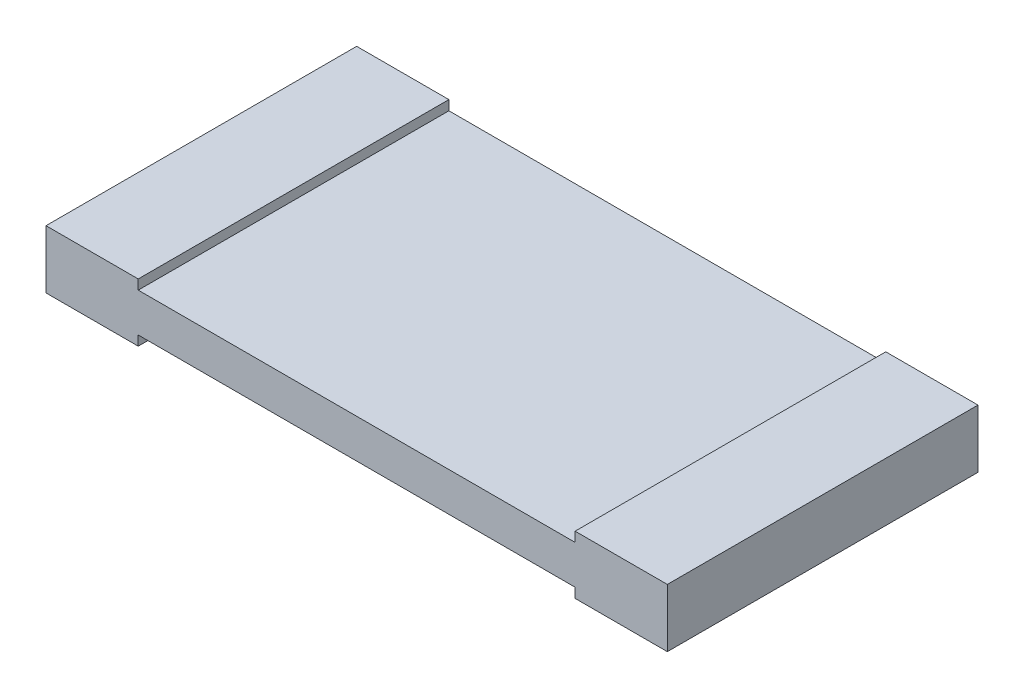
ISO-10303-21;
HEADER;
FILE_DESCRIPTION(('STEP AP214'),'2;1');
FILE_NAME('part.step','',(''),(''),'','','');
FILE_SCHEMA(('AUTOMOTIVE_DESIGN { 1 0 10303 214 1 1 1 1 }'));
ENDSEC;
DATA;
#1=APPLICATION_CONTEXT('core data for automotive mechanical design processes');
#2=APPLICATION_PROTOCOL_DEFINITION('international standard','automotive_design',2000,#1);
#3=PRODUCT_CONTEXT('',#1,'mechanical');
#4=PRODUCT('Part','Part','',(#3));
#5=PRODUCT_RELATED_PRODUCT_CATEGORY('part','',(#4));
#6=PRODUCT_DEFINITION_FORMATION('','',#4);
#7=PRODUCT_DEFINITION_CONTEXT('part definition',#1,'design');
#8=PRODUCT_DEFINITION('design','',#6,#7);
#9=PRODUCT_DEFINITION_SHAPE('','',#8);
#10=(LENGTH_UNIT() NAMED_UNIT(*) SI_UNIT(.MILLI.,.METRE.));
#11=(NAMED_UNIT(*) PLANE_ANGLE_UNIT() SI_UNIT($,.RADIAN.));
#12=(NAMED_UNIT(*) SI_UNIT($,.STERADIAN.) SOLID_ANGLE_UNIT());
#13=UNCERTAINTY_MEASURE_WITH_UNIT(LENGTH_MEASURE(1.E-05),#10,'distance_accuracy_value','');
#14=(GEOMETRIC_REPRESENTATION_CONTEXT(3) GLOBAL_UNCERTAINTY_ASSIGNED_CONTEXT((#13)) GLOBAL_UNIT_ASSIGNED_CONTEXT((#10,
#11,#12)) REPRESENTATION_CONTEXT('',''));
#15=CARTESIAN_POINT('',(0.,0.,0.));
#16=DIRECTION('',(0.,0.,1.));
#17=DIRECTION('',(1.,0.,0.));
#18=AXIS2_PLACEMENT_3D('',#15,#16,#17);
#19=CARTESIAN_POINT('',(-3.2,0.6,1.6));
#20=DIRECTION('',(0.,-1.,0.));
#21=DIRECTION('',(0.,0.,-1.));
#22=AXIS2_PLACEMENT_3D('',#19,#20,#21);
#23=PLANE('',#22);
#24=DIRECTION('',(0.,0.,-1.));
#25=VECTOR('',#24,1.);
#26=CARTESIAN_POINT('',(-2.25,0.6,0.));
#27=LINE('',#26,#25);
#28=CARTESIAN_POINT('',(-2.25,0.6,1.6));
#29=VERTEX_POINT('',#28);
#30=CARTESIAN_POINT('',(-2.25,0.6,-1.6));
#31=VERTEX_POINT('',#30);
#32=EDGE_CURVE('E123',#29,#31,#27,.T.);
#33=ORIENTED_EDGE('',*,*,#32,.T.);
#34=DIRECTION('',(1.,0.,0.));
#35=VECTOR('',#34,1.);
#36=CARTESIAN_POINT('',(-2.725,0.6,-1.6));
#37=LINE('',#36,#35);
#38=CARTESIAN_POINT('',(-3.2,0.6,-1.6));
#39=VERTEX_POINT('',#38);
#40=EDGE_CURVE('E20',#39,#31,#37,.T.);
#41=ORIENTED_EDGE('',*,*,#40,.F.);
#42=DIRECTION('',(0.,0.,1.));
#43=VECTOR('',#42,1.);
#44=CARTESIAN_POINT('',(-3.2,0.6,0.));
#45=LINE('',#44,#43);
#46=CARTESIAN_POINT('',(-3.2,0.6,1.6));
#47=VERTEX_POINT('',#46);
#48=EDGE_CURVE('E118',#39,#47,#45,.T.);
#49=ORIENTED_EDGE('',*,*,#48,.T.);
#50=DIRECTION('',(-1.,0.,0.));
#51=VECTOR('',#50,1.);
#52=CARTESIAN_POINT('',(-2.725,0.6,1.6));
#53=LINE('',#52,#51);
#54=EDGE_CURVE('E103',#29,#47,#53,.T.);
#55=ORIENTED_EDGE('',*,*,#54,.F.);
#56=EDGE_LOOP('',(#33,#41,#49,#55));
#57=FACE_BOUND('',#56,.T.);
#58=ADVANCED_FACE('F16',(#57),#23,.F.);
#59=CARTESIAN_POINT('',(-3.2,0.,1.6));
#60=DIRECTION('',(1.,0.,0.));
#61=DIRECTION('',(0.,0.,-1.));
#62=AXIS2_PLACEMENT_3D('',#59,#60,#61);
#63=PLANE('',#62);
#64=DIRECTION('',(0.,-1.,0.));
#65=VECTOR('',#64,1.);
#66=CARTESIAN_POINT('',(-3.2,0.3,1.6));
#67=LINE('',#66,#65);
#68=CARTESIAN_POINT('',(-3.2,0.,1.6));
#69=VERTEX_POINT('',#68);
#70=EDGE_CURVE('E126',#47,#69,#67,.T.);
#71=ORIENTED_EDGE('',*,*,#70,.F.);
#72=ORIENTED_EDGE('',*,*,#48,.F.);
#73=DIRECTION('',(0.,1.,0.));
#74=VECTOR('',#73,1.);
#75=CARTESIAN_POINT('',(-3.2,0.3,-1.6));
#76=LINE('',#75,#74);
#77=CARTESIAN_POINT('',(-3.2,0.,-1.6));
#78=VERTEX_POINT('',#77);
#79=EDGE_CURVE('E108',#78,#39,#76,.T.);
#80=ORIENTED_EDGE('',*,*,#79,.F.);
#81=DIRECTION('',(0.,0.,-1.));
#82=VECTOR('',#81,1.);
#83=CARTESIAN_POINT('',(-3.2,0.,0.));
#84=LINE('',#83,#82);
#85=EDGE_CURVE('E138',#69,#78,#84,.T.);
#86=ORIENTED_EDGE('',*,*,#85,.F.);
#87=EDGE_LOOP('',(#71,#72,#80,#86));
#88=FACE_BOUND('',#87,.T.);
#89=ADVANCED_FACE('F125',(#88),#63,.F.);
#90=CARTESIAN_POINT('',(-2.25,0.5,-1.6));
#91=DIRECTION('',(-1.,0.,0.));
#92=DIRECTION('',(0.,0.,1.));
#93=AXIS2_PLACEMENT_3D('',#90,#91,#92);
#94=PLANE('',#93);
#95=DIRECTION('',(0.,0.,-1.));
#96=VECTOR('',#95,1.);
#97=CARTESIAN_POINT('',(-2.25,0.5,0.));
#98=LINE('',#97,#96);
#99=CARTESIAN_POINT('',(-2.25,0.49999999995,1.6));
#100=VERTEX_POINT('',#99);
#101=CARTESIAN_POINT('',(-2.25,0.49999999995,-1.6));
#102=VERTEX_POINT('',#101);
#103=EDGE_CURVE('E140',#100,#102,#98,.T.);
#104=ORIENTED_EDGE('',*,*,#103,.T.);
#105=DIRECTION('',(0.,-1.,0.));
#106=VECTOR('',#105,1.);
#107=CARTESIAN_POINT('',(-2.25,0.55,-1.6));
#108=LINE('',#107,#106);
#109=EDGE_CURVE('E131',#31,#102,#108,.T.);
#110=ORIENTED_EDGE('',*,*,#109,.F.);
#111=ORIENTED_EDGE('',*,*,#32,.F.);
#112=DIRECTION('',(0.,1.,0.));
#113=VECTOR('',#112,1.);
#114=CARTESIAN_POINT('',(-2.25,0.55,1.6));
#115=LINE('',#114,#113);
#116=EDGE_CURVE('E133',#100,#29,#115,.T.);
#117=ORIENTED_EDGE('',*,*,#116,.F.);
#118=EDGE_LOOP('',(#104,#110,#111,#117));
#119=FACE_BOUND('',#118,.T.);
#120=ADVANCED_FACE('F222',(#119),#94,.F.);
#121=CARTESIAN_POINT('',(-3.2,0.,1.6));
#122=DIRECTION('',(0.,-1.,0.));
#123=DIRECTION('',(0.,0.,-1.));
#124=AXIS2_PLACEMENT_3D('',#121,#122,#123);
#125=PLANE('',#124);
#126=ORIENTED_EDGE('',*,*,#85,.T.);
#127=DIRECTION('',(1.,0.,0.));
#128=VECTOR('',#127,1.);
#129=CARTESIAN_POINT('',(0.,0.,-1.6));
#130=LINE('',#129,#128);
#131=CARTESIAN_POINT('',(-2.25,0.,-1.6));
#132=VERTEX_POINT('',#131);
#133=EDGE_CURVE('E113',#78,#132,#130,.T.);
#134=ORIENTED_EDGE('',*,*,#133,.T.);
#135=DIRECTION('',(0.,0.,1.));
#136=VECTOR('',#135,1.);
#137=CARTESIAN_POINT('',(-2.25,0.,0.));
#138=LINE('',#137,#136);
#139=CARTESIAN_POINT('',(-2.25,0.,1.6));
#140=VERTEX_POINT('',#139);
#141=EDGE_CURVE('E157',#132,#140,#138,.T.);
#142=ORIENTED_EDGE('',*,*,#141,.T.);
#143=DIRECTION('',(-1.,0.,0.));
#144=VECTOR('',#143,1.);
#145=CARTESIAN_POINT('',(-2.725,0.,1.6));
#146=LINE('',#145,#144);
#147=EDGE_CURVE('E135',#140,#69,#146,.T.);
#148=ORIENTED_EDGE('',*,*,#147,.T.);
#149=EDGE_LOOP('',(#126,#134,#142,#148));
#150=FACE_BOUND('',#149,.T.);
#151=ADVANCED_FACE('F224',(#150),#125,.T.);
#152=CARTESIAN_POINT('',(-2.25,0.5,1.6));
#153=DIRECTION('',(0.,-1.,0.));
#154=DIRECTION('',(0.,0.,-1.));
#155=AXIS2_PLACEMENT_3D('',#152,#153,#154);
#156=PLANE('',#155);
#157=DIRECTION('',(0.,0.,-1.));
#158=VECTOR('',#157,1.);
#159=CARTESIAN_POINT('',(2.25,0.5,0.));
#160=LINE('',#159,#158);
#161=CARTESIAN_POINT('',(2.25,0.49999999995,1.6));
#162=VERTEX_POINT('',#161);
#163=CARTESIAN_POINT('',(2.25,0.49999999995,-1.6));
#164=VERTEX_POINT('',#163);
#165=EDGE_CURVE('E172',#162,#164,#160,.T.);
#166=ORIENTED_EDGE('',*,*,#165,.T.);
#167=DIRECTION('',(-1.,0.,0.));
#168=VECTOR('',#167,1.);
#169=CARTESIAN_POINT('',(0.,0.4999999998,-1.6));
#170=LINE('',#169,#168);
#171=EDGE_CURVE('E147',#164,#102,#170,.T.);
#172=ORIENTED_EDGE('',*,*,#171,.T.);
#173=ORIENTED_EDGE('',*,*,#103,.F.);
#174=DIRECTION('',(1.,0.,0.));
#175=VECTOR('',#174,1.);
#176=CARTESIAN_POINT('',(0.,0.4999999998,1.6));
#177=LINE('',#176,#175);
#178=EDGE_CURVE('E163',#100,#162,#177,.T.);
#179=ORIENTED_EDGE('',*,*,#178,.T.);
#180=EDGE_LOOP('',(#166,#172,#173,#179));
#181=FACE_BOUND('',#180,.T.);
#182=ADVANCED_FACE('F219',(#181),#156,.F.);
#183=CARTESIAN_POINT('',(-3.2,0.,-1.6));
#184=DIRECTION('',(0.,0.,1.));
#185=DIRECTION('',(1.,0.,0.));
#186=AXIS2_PLACEMENT_3D('',#183,#184,#185);
#187=PLANE('',#186);
#188=DIRECTION('',(0.,-1.,0.));
#189=VECTOR('',#188,1.);
#190=CARTESIAN_POINT('',(2.25,0.3,-1.6));
#191=LINE('',#190,#189);
#192=CARTESIAN_POINT('',(2.25,0.1000000001,-1.6));
#193=VERTEX_POINT('',#192);
#194=CARTESIAN_POINT('',(2.25,0.,-1.6));
#195=VERTEX_POINT('',#194);
#196=EDGE_CURVE('E151',#193,#195,#191,.T.);
#197=ORIENTED_EDGE('',*,*,#196,.F.);
#198=DIRECTION('',(-1.,0.,0.));
#199=VECTOR('',#198,1.);
#200=CARTESIAN_POINT('',(0.,0.1,-1.6));
#201=LINE('',#200,#199);
#202=CARTESIAN_POINT('',(-2.25,0.1000000001,-1.6));
#203=VERTEX_POINT('',#202);
#204=EDGE_CURVE('E180',#193,#203,#201,.T.);
#205=ORIENTED_EDGE('',*,*,#204,.T.);
#206=DIRECTION('',(0.,-1.,0.));
#207=VECTOR('',#206,1.);
#208=CARTESIAN_POINT('',(-2.25,0.05,-1.6));
#209=LINE('',#208,#207);
#210=EDGE_CURVE('E155',#203,#132,#209,.T.);
#211=ORIENTED_EDGE('',*,*,#210,.T.);
#212=ORIENTED_EDGE('',*,*,#133,.F.);
#213=ORIENTED_EDGE('',*,*,#79,.T.);
#214=ORIENTED_EDGE('',*,*,#40,.T.);
#215=ORIENTED_EDGE('',*,*,#109,.T.);
#216=ORIENTED_EDGE('',*,*,#171,.F.);
#217=DIRECTION('',(0.,1.,0.));
#218=VECTOR('',#217,1.);
#219=CARTESIAN_POINT('',(2.25,0.55,-1.6));
#220=LINE('',#219,#218);
#221=CARTESIAN_POINT('',(2.25,0.6,-1.6));
#222=VERTEX_POINT('',#221);
#223=EDGE_CURVE('E174',#164,#222,#220,.T.);
#224=ORIENTED_EDGE('',*,*,#223,.T.);
#225=DIRECTION('',(-1.,0.,0.));
#226=VECTOR('',#225,1.);
#227=CARTESIAN_POINT('',(0.,0.6,-1.6));
#228=LINE('',#227,#226);
#229=CARTESIAN_POINT('',(3.2,0.6,-1.6));
#230=VERTEX_POINT('',#229);
#231=EDGE_CURVE('E145',#230,#222,#228,.T.);
#232=ORIENTED_EDGE('',*,*,#231,.F.);
#233=DIRECTION('',(0.,1.,0.));
#234=VECTOR('',#233,1.);
#235=CARTESIAN_POINT('',(3.2,0.3,-1.6));
#236=LINE('',#235,#234);
#237=CARTESIAN_POINT('',(3.2,0.,-1.6));
#238=VERTEX_POINT('',#237);
#239=EDGE_CURVE('E143',#238,#230,#236,.T.);
#240=ORIENTED_EDGE('',*,*,#239,.F.);
#241=DIRECTION('',(1.,0.,0.));
#242=VECTOR('',#241,1.);
#243=CARTESIAN_POINT('',(0.,0.,-1.6));
#244=LINE('',#243,#242);
#245=EDGE_CURVE('E153',#195,#238,#244,.T.);
#246=ORIENTED_EDGE('',*,*,#245,.F.);
#247=EDGE_LOOP('',(#197,#205,#211,#212,#213,#214,#215,#216,#224,#232,#240,#246));
#248=FACE_BOUND('',#247,.T.);
#249=ADVANCED_FACE('F110',(#248),#187,.F.);
#250=CARTESIAN_POINT('',(-2.25,0.,-1.6));
#251=DIRECTION('',(-1.,0.,0.));
#252=DIRECTION('',(0.,0.,1.));
#253=AXIS2_PLACEMENT_3D('',#250,#251,#252);
#254=PLANE('',#253);
#255=ORIENTED_EDGE('',*,*,#141,.F.);
#256=ORIENTED_EDGE('',*,*,#210,.F.);
#257=DIRECTION('',(0.,0.,1.));
#258=VECTOR('',#257,1.);
#259=CARTESIAN_POINT('',(-2.25,0.1,0.));
#260=LINE('',#259,#258);
#261=CARTESIAN_POINT('',(-2.25,0.10000000005,1.6));
#262=VERTEX_POINT('',#261);
#263=EDGE_CURVE('E182',#203,#262,#260,.T.);
#264=ORIENTED_EDGE('',*,*,#263,.T.);
#265=DIRECTION('',(0.,-1.,0.));
#266=VECTOR('',#265,1.);
#267=CARTESIAN_POINT('',(-2.25,0.3,1.6));
#268=LINE('',#267,#266);
#269=EDGE_CURVE('E160',#262,#140,#268,.T.);
#270=ORIENTED_EDGE('',*,*,#269,.T.);
#271=EDGE_LOOP('',(#255,#256,#264,#270));
#272=FACE_BOUND('',#271,.T.);
#273=ADVANCED_FACE('F254',(#272),#254,.F.);
#274=CARTESIAN_POINT('',(3.2,0.,1.6));
#275=DIRECTION('',(0.,0.,-1.));
#276=DIRECTION('',(-1.,0.,0.));
#277=AXIS2_PLACEMENT_3D('',#274,#275,#276);
#278=PLANE('',#277);
#279=DIRECTION('',(0.,1.,0.));
#280=VECTOR('',#279,1.);
#281=CARTESIAN_POINT('',(2.25,0.3,1.6));
#282=LINE('',#281,#280);
#283=CARTESIAN_POINT('',(2.25,0.,1.6));
#284=VERTEX_POINT('',#283);
#285=CARTESIAN_POINT('',(2.25,0.1000000001,1.6));
#286=VERTEX_POINT('',#285);
#287=EDGE_CURVE('E35',#284,#286,#282,.T.);
#288=ORIENTED_EDGE('',*,*,#287,.F.);
#289=DIRECTION('',(-1.,0.,0.));
#290=VECTOR('',#289,1.);
#291=CARTESIAN_POINT('',(0.,0.,1.6));
#292=LINE('',#291,#290);
#293=CARTESIAN_POINT('',(3.2,0.,1.6));
#294=VERTEX_POINT('',#293);
#295=EDGE_CURVE('E169',#294,#284,#292,.T.);
#296=ORIENTED_EDGE('',*,*,#295,.F.);
#297=DIRECTION('',(0.,-1.,0.));
#298=VECTOR('',#297,1.);
#299=CARTESIAN_POINT('',(3.2,0.3,1.6));
#300=LINE('',#299,#298);
#301=CARTESIAN_POINT('',(3.2,0.6,1.6));
#302=VERTEX_POINT('',#301);
#303=EDGE_CURVE('E167',#302,#294,#300,.T.);
#304=ORIENTED_EDGE('',*,*,#303,.F.);
#305=DIRECTION('',(1.,0.,0.));
#306=VECTOR('',#305,1.);
#307=CARTESIAN_POINT('',(0.,0.6,1.6));
#308=LINE('',#307,#306);
#309=CARTESIAN_POINT('',(2.25,0.6,1.6));
#310=VERTEX_POINT('',#309);
#311=EDGE_CURVE('E165',#310,#302,#308,.T.);
#312=ORIENTED_EDGE('',*,*,#311,.F.);
#313=DIRECTION('',(0.,-1.,0.));
#314=VECTOR('',#313,1.);
#315=CARTESIAN_POINT('',(2.25,0.55,1.6));
#316=LINE('',#315,#314);
#317=EDGE_CURVE('E177',#310,#162,#316,.T.);
#318=ORIENTED_EDGE('',*,*,#317,.T.);
#319=ORIENTED_EDGE('',*,*,#178,.F.);
#320=ORIENTED_EDGE('',*,*,#116,.T.);
#321=ORIENTED_EDGE('',*,*,#54,.T.);
#322=ORIENTED_EDGE('',*,*,#70,.T.);
#323=ORIENTED_EDGE('',*,*,#147,.F.);
#324=ORIENTED_EDGE('',*,*,#269,.F.);
#325=DIRECTION('',(1.,0.,0.));
#326=VECTOR('',#325,1.);
#327=CARTESIAN_POINT('',(0.,0.1,1.6));
#328=LINE('',#327,#326);
#329=EDGE_CURVE('E184',#262,#286,#328,.T.);
#330=ORIENTED_EDGE('',*,*,#329,.T.);
#331=EDGE_LOOP('',(#288,#296,#304,#312,#318,#319,#320,#321,#322,#323,#324,#330));
#332=FACE_BOUND('',#331,.T.);
#333=ADVANCED_FACE('F211',(#332),#278,.F.);
#334=CARTESIAN_POINT('',(2.25,0.5,-1.6));
#335=DIRECTION('',(1.,0.,0.));
#336=DIRECTION('',(0.,1.,0.));
#337=AXIS2_PLACEMENT_3D('',#334,#335,#336);
#338=PLANE('',#337);
#339=DIRECTION('',(0.,0.,-1.));
#340=VECTOR('',#339,1.);
#341=CARTESIAN_POINT('',(2.25,0.6,0.));
#342=LINE('',#341,#340);
#343=EDGE_CURVE('E186',#310,#222,#342,.T.);
#344=ORIENTED_EDGE('',*,*,#343,.T.);
#345=ORIENTED_EDGE('',*,*,#223,.F.);
#346=ORIENTED_EDGE('',*,*,#165,.F.);
#347=ORIENTED_EDGE('',*,*,#317,.F.);
#348=EDGE_LOOP('',(#344,#345,#346,#347));
#349=FACE_BOUND('',#348,.T.);
#350=ADVANCED_FACE('F215',(#349),#338,.F.);
#351=CARTESIAN_POINT('',(2.25,0.1,-1.6));
#352=DIRECTION('',(0.,1.,0.));
#353=DIRECTION('',(-1.,0.,0.));
#354=AXIS2_PLACEMENT_3D('',#351,#352,#353);
#355=PLANE('',#354);
#356=ORIENTED_EDGE('',*,*,#263,.F.);
#357=ORIENTED_EDGE('',*,*,#204,.F.);
#358=DIRECTION('',(0.,0.,1.));
#359=VECTOR('',#358,1.);
#360=CARTESIAN_POINT('',(2.25,0.1,0.));
#361=LINE('',#360,#359);
#362=EDGE_CURVE('E189',#193,#286,#361,.T.);
#363=ORIENTED_EDGE('',*,*,#362,.T.);
#364=ORIENTED_EDGE('',*,*,#329,.F.);
#365=EDGE_LOOP('',(#356,#357,#363,#364));
#366=FACE_BOUND('',#365,.T.);
#367=ADVANCED_FACE('F246',(#366),#355,.F.);
#368=CARTESIAN_POINT('',(2.25,0.6,1.6));
#369=DIRECTION('',(0.,-1.,0.));
#370=DIRECTION('',(0.,0.,-1.));
#371=AXIS2_PLACEMENT_3D('',#368,#369,#370);
#372=PLANE('',#371);
#373=ORIENTED_EDGE('',*,*,#343,.F.);
#374=ORIENTED_EDGE('',*,*,#311,.T.);
#375=DIRECTION('',(0.,0.,-1.));
#376=VECTOR('',#375,1.);
#377=CARTESIAN_POINT('',(3.2,0.6,0.));
#378=LINE('',#377,#376);
#379=EDGE_CURVE('E192',#302,#230,#378,.T.);
#380=ORIENTED_EDGE('',*,*,#379,.T.);
#381=ORIENTED_EDGE('',*,*,#231,.T.);
#382=EDGE_LOOP('',(#373,#374,#380,#381));
#383=FACE_BOUND('',#382,.T.);
#384=ADVANCED_FACE('F209',(#383),#372,.F.);
#385=CARTESIAN_POINT('',(2.25,0.,-1.6));
#386=DIRECTION('',(1.,0.,0.));
#387=DIRECTION('',(0.,1.,0.));
#388=AXIS2_PLACEMENT_3D('',#385,#386,#387);
#389=PLANE('',#388);
#390=ORIENTED_EDGE('',*,*,#362,.F.);
#391=ORIENTED_EDGE('',*,*,#196,.T.);
#392=DIRECTION('',(0.,0.,-1.));
#393=VECTOR('',#392,1.);
#394=CARTESIAN_POINT('',(2.25,0.,0.));
#395=LINE('',#394,#393);
#396=EDGE_CURVE('E26',#284,#195,#395,.T.);
#397=ORIENTED_EDGE('',*,*,#396,.F.);
#398=ORIENTED_EDGE('',*,*,#287,.T.);
#399=EDGE_LOOP('',(#390,#391,#397,#398));
#400=FACE_BOUND('',#399,.T.);
#401=ADVANCED_FACE('F238',(#400),#389,.F.);
#402=CARTESIAN_POINT('',(3.2,0.,-1.6));
#403=DIRECTION('',(-1.,0.,0.));
#404=DIRECTION('',(0.,0.,1.));
#405=AXIS2_PLACEMENT_3D('',#402,#403,#404);
#406=PLANE('',#405);
#407=ORIENTED_EDGE('',*,*,#239,.T.);
#408=ORIENTED_EDGE('',*,*,#379,.F.);
#409=ORIENTED_EDGE('',*,*,#303,.T.);
#410=DIRECTION('',(0.,0.,1.));
#411=VECTOR('',#410,1.);
#412=CARTESIAN_POINT('',(3.2,0.,0.));
#413=LINE('',#412,#411);
#414=EDGE_CURVE('E11',#238,#294,#413,.T.);
#415=ORIENTED_EDGE('',*,*,#414,.F.);
#416=EDGE_LOOP('',(#407,#408,#409,#415));
#417=FACE_BOUND('',#416,.T.);
#418=ADVANCED_FACE('F205',(#417),#406,.F.);
#419=CARTESIAN_POINT('',(2.25,0.,1.6));
#420=DIRECTION('',(0.,-1.,0.));
#421=DIRECTION('',(0.,0.,-1.));
#422=AXIS2_PLACEMENT_3D('',#419,#420,#421);
#423=PLANE('',#422);
#424=ORIENTED_EDGE('',*,*,#414,.T.);
#425=ORIENTED_EDGE('',*,*,#295,.T.);
#426=ORIENTED_EDGE('',*,*,#396,.T.);
#427=ORIENTED_EDGE('',*,*,#245,.T.);
#428=EDGE_LOOP('',(#424,#425,#426,#427));
#429=FACE_BOUND('',#428,.T.);
#430=ADVANCED_FACE('F18',(#429),#423,.T.);
#431=CLOSED_SHELL('',(#58,#89,#120,#151,#182,#249,#273,#333,#350,#367,#384,#401,#418,#430));
#432=MANIFOLD_SOLID_BREP('B1',#431);
#433=ADVANCED_BREP_SHAPE_REPRESENTATION('',(#18,#432),#14);
#434=SHAPE_DEFINITION_REPRESENTATION(#9,#433);
ENDSEC;
END-ISO-10303-21;
